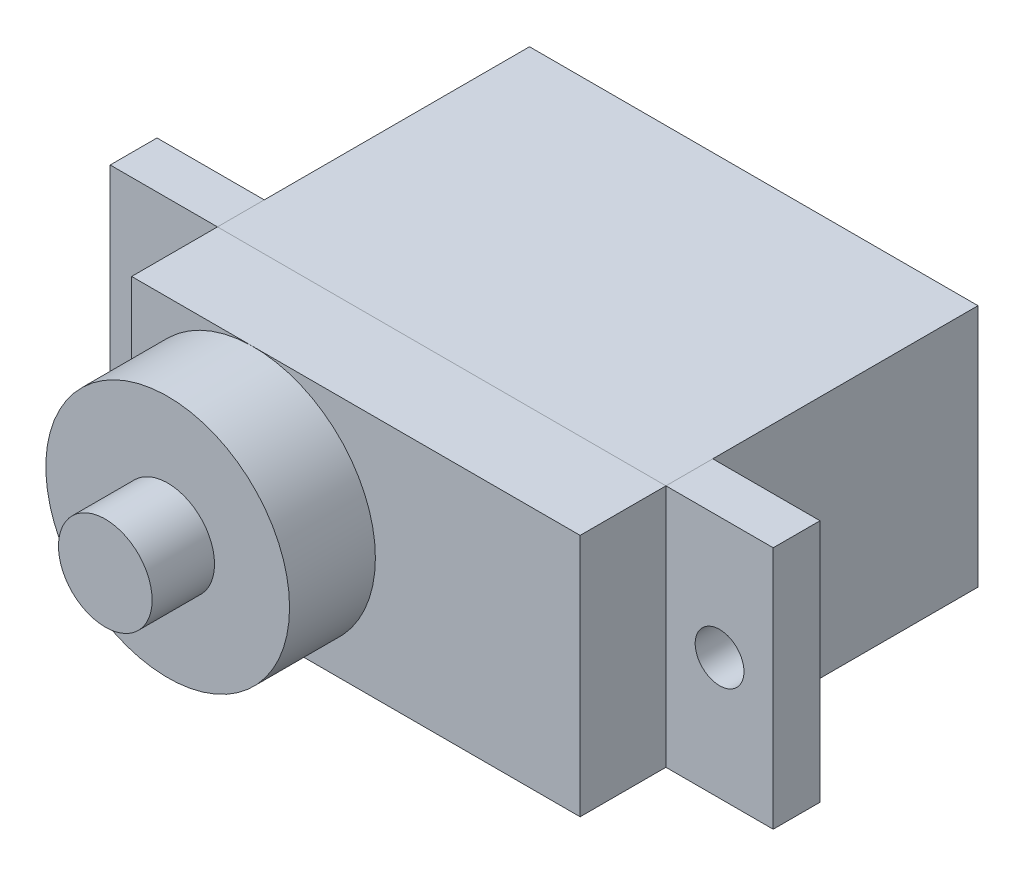
ISO-10303-21;
HEADER;
FILE_DESCRIPTION(('STEP AP214'),'2;1');
FILE_NAME('part.step','',(''),(''),'','','');
FILE_SCHEMA(('AUTOMOTIVE_DESIGN { 1 0 10303 214 1 1 1 1 }'));
ENDSEC;
DATA;
#1=APPLICATION_CONTEXT('core data for automotive mechanical design processes');
#2=APPLICATION_PROTOCOL_DEFINITION('international standard','automotive_design',2000,#1);
#3=PRODUCT_CONTEXT('',#1,'mechanical');
#4=PRODUCT('Part','Part','',(#3));
#5=PRODUCT_RELATED_PRODUCT_CATEGORY('part','',(#4));
#6=PRODUCT_DEFINITION_FORMATION('','',#4);
#7=PRODUCT_DEFINITION_CONTEXT('part definition',#1,'design');
#8=PRODUCT_DEFINITION('design','',#6,#7);
#9=PRODUCT_DEFINITION_SHAPE('','',#8);
#10=(LENGTH_UNIT() NAMED_UNIT(*) SI_UNIT(.MILLI.,.METRE.));
#11=(NAMED_UNIT(*) PLANE_ANGLE_UNIT() SI_UNIT($,.RADIAN.));
#12=(NAMED_UNIT(*) SI_UNIT($,.STERADIAN.) SOLID_ANGLE_UNIT());
#13=UNCERTAINTY_MEASURE_WITH_UNIT(LENGTH_MEASURE(1.E-05),#10,'distance_accuracy_value','');
#14=(GEOMETRIC_REPRESENTATION_CONTEXT(3) GLOBAL_UNCERTAINTY_ASSIGNED_CONTEXT((#13)) GLOBAL_UNIT_ASSIGNED_CONTEXT((#10,
#11,#12)) REPRESENTATION_CONTEXT('',''));
#15=CARTESIAN_POINT('',(0.,0.,0.));
#16=DIRECTION('',(0.,0.,1.));
#17=DIRECTION('',(1.,0.,0.));
#18=AXIS2_PLACEMENT_3D('',#15,#16,#17);
#19=CARTESIAN_POINT('',(222.577910820863,143.525833459981,0.));
#20=DIRECTION('',(0.,0.,1.));
#21=DIRECTION('',(1.,0.,0.));
#22=AXIS2_PLACEMENT_3D('',#19,#20,#21);
#23=CYLINDRICAL_SURFACE('',#22,1.25);
#24=CARTESIAN_POINT('',(222.577910820863,143.525833459981,-2.4));
#25=DIRECTION('',(0.,0.,1.));
#26=DIRECTION('',(1.,0.,0.));
#27=AXIS2_PLACEMENT_3D('',#24,#25,#26);
#28=CIRCLE('',#27,1.25);
#29=CARTESIAN_POINT('',(221.327910820863,143.525833459981,-2.4));
#30=VERTEX_POINT('',#29);
#31=EDGE_CURVE('P0_E35',#30,#30,#28,.T.);
#32=ORIENTED_EDGE('',*,*,#31,.F.);
#33=EDGE_LOOP('',(#32));
#34=FACE_BOUND('',#33,.T.);
#35=CARTESIAN_POINT('',(222.577910820863,143.525833459981,0.));
#36=DIRECTION('',(0.,0.,-1.));
#37=DIRECTION('',(1.,0.,0.));
#38=AXIS2_PLACEMENT_3D('',#35,#36,#37);
#39=CIRCLE('',#38,1.25);
#40=CARTESIAN_POINT('',(221.327910820863,143.525833459981,0.));
#41=VERTEX_POINT('',#40);
#42=EDGE_CURVE('P0_E109',#41,#41,#39,.T.);
#43=ORIENTED_EDGE('',*,*,#42,.F.);
#44=EDGE_LOOP('',(#43));
#45=FACE_BOUND('',#44,.T.);
#46=ADVANCED_FACE('P0_F17',(#34,#45),#23,.F.);
#47=CARTESIAN_POINT('',(225.327910820863,149.775833459981,0.));
#48=DIRECTION('',(1.,0.,0.));
#49=DIRECTION('',(0.,-1.,0.));
#50=AXIS2_PLACEMENT_3D('',#47,#48,#49);
#51=PLANE('',#50);
#52=DIRECTION('',(0.,1.,0.));
#53=VECTOR('',#52,1.);
#54=CARTESIAN_POINT('',(225.327910820863,137.275833459981,0.));
#55=LINE('',#54,#53);
#56=CARTESIAN_POINT('',(225.327910820863,137.275833459981,0.));
#57=VERTEX_POINT('',#56);
#58=CARTESIAN_POINT('',(225.327910820863,149.775833459981,0.));
#59=VERTEX_POINT('',#58);
#60=EDGE_CURVE('P0_E60',#57,#59,#55,.T.);
#61=ORIENTED_EDGE('',*,*,#60,.F.);
#62=DIRECTION('',(0.,0.,-1.));
#63=VECTOR('',#62,1.);
#64=CARTESIAN_POINT('',(225.327910820863,137.275833459981,0.));
#65=LINE('',#64,#63);
#66=CARTESIAN_POINT('',(225.327910820863,137.275833459981,-2.4));
#67=VERTEX_POINT('',#66);
#68=EDGE_CURVE('P0_E11',#57,#67,#65,.T.);
#69=ORIENTED_EDGE('',*,*,#68,.T.);
#70=DIRECTION('',(0.,-1.,0.));
#71=VECTOR('',#70,1.);
#72=CARTESIAN_POINT('',(225.327910820863,137.275833459981,-2.4));
#73=LINE('',#72,#71);
#74=CARTESIAN_POINT('',(225.327910820863,149.775833459981,-2.4));
#75=VERTEX_POINT('',#74);
#76=EDGE_CURVE('P0_E75',#75,#67,#73,.T.);
#77=ORIENTED_EDGE('',*,*,#76,.F.);
#78=DIRECTION('',(0.,0.,-1.));
#79=VECTOR('',#78,1.);
#80=CARTESIAN_POINT('',(225.327910820863,149.775833459981,0.));
#81=LINE('',#80,#79);
#82=EDGE_CURVE('P0_E28',#59,#75,#81,.T.);
#83=ORIENTED_EDGE('',*,*,#82,.F.);
#84=EDGE_LOOP('',(#61,#69,#77,#83));
#85=FACE_BOUND('',#84,.T.);
#86=ADVANCED_FACE('P0_F73',(#85),#51,.T.);
#87=CARTESIAN_POINT('',(219.827910820863,149.775833459981,0.));
#88=DIRECTION('',(0.,1.,0.));
#89=DIRECTION('',(1.,0.,0.));
#90=AXIS2_PLACEMENT_3D('',#87,#88,#89);
#91=PLANE('',#90);
#92=DIRECTION('',(-1.,0.,0.));
#93=VECTOR('',#92,1.);
#94=CARTESIAN_POINT('',(225.327910820863,149.775833459981,0.));
#95=LINE('',#94,#93);
#96=CARTESIAN_POINT('',(219.827910820863,149.775833459981,0.));
#97=VERTEX_POINT('',#96);
#98=EDGE_CURVE('P0_E64',#59,#97,#95,.T.);
#99=ORIENTED_EDGE('',*,*,#98,.F.);
#100=ORIENTED_EDGE('',*,*,#82,.T.);
#101=DIRECTION('',(1.,0.,0.));
#102=VECTOR('',#101,1.);
#103=CARTESIAN_POINT('',(225.327910820863,149.775833459981,-2.4));
#104=LINE('',#103,#102);
#105=CARTESIAN_POINT('',(219.827910820863,149.775833459981,-2.4));
#106=VERTEX_POINT('',#105);
#107=EDGE_CURVE('P0_E91',#106,#75,#104,.T.);
#108=ORIENTED_EDGE('',*,*,#107,.F.);
#109=DIRECTION('',(0.,0.,-1.));
#110=VECTOR('',#109,1.);
#111=CARTESIAN_POINT('',(219.827910820863,149.775833459981,0.));
#112=LINE('',#111,#110);
#113=EDGE_CURVE('P0_E79',#97,#106,#112,.T.);
#114=ORIENTED_EDGE('',*,*,#113,.F.);
#115=EDGE_LOOP('',(#99,#100,#108,#114));
#116=FACE_BOUND('',#115,.T.);
#117=ADVANCED_FACE('P0_F19',(#116),#91,.T.);
#118=CARTESIAN_POINT('',(219.827910820863,137.275833459981,0.));
#119=DIRECTION('',(-1.,0.,0.));
#120=DIRECTION('',(0.,1.,0.));
#121=AXIS2_PLACEMENT_3D('',#118,#119,#120);
#122=PLANE('',#121);
#123=DIRECTION('',(0.,-1.,0.));
#124=VECTOR('',#123,1.);
#125=CARTESIAN_POINT('',(219.827910820863,149.775833459981,0.));
#126=LINE('',#125,#124);
#127=CARTESIAN_POINT('',(219.827910820863,137.275833459981,0.));
#128=VERTEX_POINT('',#127);
#129=EDGE_CURVE('P0_E21',#97,#128,#126,.T.);
#130=ORIENTED_EDGE('',*,*,#129,.F.);
#131=ORIENTED_EDGE('',*,*,#113,.T.);
#132=DIRECTION('',(0.,1.,0.));
#133=VECTOR('',#132,1.);
#134=CARTESIAN_POINT('',(219.827910820863,149.775833459981,-2.4));
#135=LINE('',#134,#133);
#136=CARTESIAN_POINT('',(219.827910820863,137.275833459981,-2.4));
#137=VERTEX_POINT('',#136);
#138=EDGE_CURVE('P0_E89',#137,#106,#135,.T.);
#139=ORIENTED_EDGE('',*,*,#138,.F.);
#140=DIRECTION('',(0.,0.,-1.));
#141=VECTOR('',#140,1.);
#142=CARTESIAN_POINT('',(219.827910820863,137.275833459981,0.));
#143=LINE('',#142,#141);
#144=EDGE_CURVE('P0_E106',#128,#137,#143,.T.);
#145=ORIENTED_EDGE('',*,*,#144,.F.);
#146=EDGE_LOOP('',(#130,#131,#139,#145));
#147=FACE_BOUND('',#146,.T.);
#148=ADVANCED_FACE('P0_F147',(#147),#122,.T.);
#149=CARTESIAN_POINT('',(225.327910820863,137.275833459981,0.));
#150=DIRECTION('',(0.,-1.,0.));
#151=DIRECTION('',(-1.,0.,0.));
#152=AXIS2_PLACEMENT_3D('',#149,#150,#151);
#153=PLANE('',#152);
#154=DIRECTION('',(1.,0.,0.));
#155=VECTOR('',#154,1.);
#156=CARTESIAN_POINT('',(219.827910820863,137.275833459981,0.));
#157=LINE('',#156,#155);
#158=EDGE_CURVE('P0_E67',#128,#57,#157,.T.);
#159=ORIENTED_EDGE('',*,*,#158,.F.);
#160=ORIENTED_EDGE('',*,*,#144,.T.);
#161=DIRECTION('',(-1.,0.,0.));
#162=VECTOR('',#161,1.);
#163=CARTESIAN_POINT('',(219.827910820863,137.275833459981,-2.4));
#164=LINE('',#163,#162);
#165=EDGE_CURVE('P0_E98',#67,#137,#164,.T.);
#166=ORIENTED_EDGE('',*,*,#165,.F.);
#167=ORIENTED_EDGE('',*,*,#68,.F.);
#168=EDGE_LOOP('',(#159,#160,#166,#167));
#169=FACE_BOUND('',#168,.T.);
#170=ADVANCED_FACE('P0_F138',(#169),#153,.T.);
#171=CARTESIAN_POINT('',(222.577910820863,143.525833459981,0.));
#172=DIRECTION('',(0.,0.,1.));
#173=DIRECTION('',(1.,0.,0.));
#174=AXIS2_PLACEMENT_3D('',#171,#172,#173);
#175=PLANE('',#174);
#176=ORIENTED_EDGE('',*,*,#42,.T.);
#177=EDGE_LOOP('',(#176));
#178=FACE_BOUND('',#177,.T.);
#179=ORIENTED_EDGE('',*,*,#158,.T.);
#180=ORIENTED_EDGE('',*,*,#60,.T.);
#181=ORIENTED_EDGE('',*,*,#98,.T.);
#182=ORIENTED_EDGE('',*,*,#129,.T.);
#183=EDGE_LOOP('',(#179,#180,#181,#182));
#184=FACE_BOUND('',#183,.T.);
#185=ADVANCED_FACE('P0_F62',(#178,#184),#175,.T.);
#186=CARTESIAN_POINT('',(222.577910820863,143.525833459981,-2.4));
#187=DIRECTION('',(0.,0.,1.));
#188=DIRECTION('',(1.,0.,0.));
#189=AXIS2_PLACEMENT_3D('',#186,#187,#188);
#190=PLANE('',#189);
#191=ORIENTED_EDGE('',*,*,#31,.T.);
#192=EDGE_LOOP('',(#191));
#193=FACE_BOUND('',#192,.T.);
#194=ORIENTED_EDGE('',*,*,#165,.T.);
#195=ORIENTED_EDGE('',*,*,#138,.T.);
#196=ORIENTED_EDGE('',*,*,#107,.T.);
#197=ORIENTED_EDGE('',*,*,#76,.T.);
#198=EDGE_LOOP('',(#194,#195,#196,#197));
#199=FACE_BOUND('',#198,.T.);
#200=ADVANCED_FACE('P0_F125',(#193,#199),#190,.F.);
#201=CLOSED_SHELL('',(#46,#86,#117,#148,#170,#185,#200));
#202=MANIFOLD_SOLID_BREP('P0_B1',#201);
#203=CARTESIAN_POINT('',(251.073310820863,143.525833459981,0.));
#204=DIRECTION('',(0.,0.,1.));
#205=DIRECTION('',(-1.,0.,0.));
#206=AXIS2_PLACEMENT_3D('',#203,#204,#205);
#207=CYLINDRICAL_SURFACE('',#206,1.25);
#208=CARTESIAN_POINT('',(251.073310820863,143.525833459981,-2.4));
#209=DIRECTION('',(0.,0.,1.));
#210=DIRECTION('',(-1.,0.,0.));
#211=AXIS2_PLACEMENT_3D('',#208,#209,#210);
#212=CIRCLE('',#211,1.25);
#213=CARTESIAN_POINT('',(252.323310820863,143.525833459981,-2.4));
#214=VERTEX_POINT('',#213);
#215=EDGE_CURVE('P1_E35',#214,#214,#212,.T.);
#216=ORIENTED_EDGE('',*,*,#215,.F.);
#217=EDGE_LOOP('',(#216));
#218=FACE_BOUND('',#217,.T.);
#219=CARTESIAN_POINT('',(251.073310820863,143.525833459981,0.));
#220=DIRECTION('',(0.,0.,-1.));
#221=DIRECTION('',(-1.,0.,0.));
#222=AXIS2_PLACEMENT_3D('',#219,#220,#221);
#223=CIRCLE('',#222,1.25);
#224=CARTESIAN_POINT('',(252.323310820863,143.525833459981,0.));
#225=VERTEX_POINT('',#224);
#226=EDGE_CURVE('P1_E21',#225,#225,#223,.T.);
#227=ORIENTED_EDGE('',*,*,#226,.F.);
#228=EDGE_LOOP('',(#227));
#229=FACE_BOUND('',#228,.T.);
#230=ADVANCED_FACE('P1_F17',(#218,#229),#207,.F.);
#231=CARTESIAN_POINT('',(248.323310820863,149.775833459981,0.));
#232=DIRECTION('',(0.,1.,0.));
#233=DIRECTION('',(1.,0.,0.));
#234=AXIS2_PLACEMENT_3D('',#231,#232,#233);
#235=PLANE('',#234);
#236=DIRECTION('',(-1.,0.,0.));
#237=VECTOR('',#236,1.);
#238=CARTESIAN_POINT('',(253.823310820864,149.775833459981,0.));
#239=LINE('',#238,#237);
#240=CARTESIAN_POINT('',(253.823310820864,149.775833459981,0.));
#241=VERTEX_POINT('',#240);
#242=CARTESIAN_POINT('',(248.323310820863,149.775833459981,0.));
#243=VERTEX_POINT('',#242);
#244=EDGE_CURVE('P1_E74',#241,#243,#239,.T.);
#245=ORIENTED_EDGE('',*,*,#244,.F.);
#246=DIRECTION('',(0.,0.,-1.));
#247=VECTOR('',#246,1.);
#248=CARTESIAN_POINT('',(253.823310820864,149.775833459981,0.));
#249=LINE('',#248,#247);
#250=CARTESIAN_POINT('',(253.823310820864,149.775833459981,-2.4));
#251=VERTEX_POINT('',#250);
#252=EDGE_CURVE('P1_E11',#241,#251,#249,.T.);
#253=ORIENTED_EDGE('',*,*,#252,.T.);
#254=DIRECTION('',(1.,0.,0.));
#255=VECTOR('',#254,1.);
#256=CARTESIAN_POINT('',(253.823310820864,149.775833459981,-2.4));
#257=LINE('',#256,#255);
#258=CARTESIAN_POINT('',(248.323310820863,149.775833459981,-2.4));
#259=VERTEX_POINT('',#258);
#260=EDGE_CURVE('P1_E71',#259,#251,#257,.T.);
#261=ORIENTED_EDGE('',*,*,#260,.F.);
#262=DIRECTION('',(0.,0.,-1.));
#263=VECTOR('',#262,1.);
#264=CARTESIAN_POINT('',(248.323310820863,149.775833459981,0.));
#265=LINE('',#264,#263);
#266=EDGE_CURVE('P1_E28',#243,#259,#265,.T.);
#267=ORIENTED_EDGE('',*,*,#266,.F.);
#268=EDGE_LOOP('',(#245,#253,#261,#267));
#269=FACE_BOUND('',#268,.T.);
#270=ADVANCED_FACE('P1_F81',(#269),#235,.T.);
#271=CARTESIAN_POINT('',(248.323310820863,137.275833459981,0.));
#272=DIRECTION('',(-1.,0.,0.));
#273=DIRECTION('',(0.,1.,0.));
#274=AXIS2_PLACEMENT_3D('',#271,#272,#273);
#275=PLANE('',#274);
#276=DIRECTION('',(0.,-1.,0.));
#277=VECTOR('',#276,1.);
#278=CARTESIAN_POINT('',(248.323310820863,149.775833459981,0.));
#279=LINE('',#278,#277);
#280=CARTESIAN_POINT('',(248.323310820863,137.275833459981,0.));
#281=VERTEX_POINT('',#280);
#282=EDGE_CURVE('P1_E54',#243,#281,#279,.T.);
#283=ORIENTED_EDGE('',*,*,#282,.F.);
#284=ORIENTED_EDGE('',*,*,#266,.T.);
#285=DIRECTION('',(0.,1.,0.));
#286=VECTOR('',#285,1.);
#287=CARTESIAN_POINT('',(248.323310820863,149.775833459981,-2.4));
#288=LINE('',#287,#286);
#289=CARTESIAN_POINT('',(248.323310820863,137.275833459981,-2.4));
#290=VERTEX_POINT('',#289);
#291=EDGE_CURVE('P1_E103',#290,#259,#288,.T.);
#292=ORIENTED_EDGE('',*,*,#291,.F.);
#293=DIRECTION('',(0.,0.,-1.));
#294=VECTOR('',#293,1.);
#295=CARTESIAN_POINT('',(248.323310820863,137.275833459981,0.));
#296=LINE('',#295,#294);
#297=EDGE_CURVE('P1_E85',#281,#290,#296,.T.);
#298=ORIENTED_EDGE('',*,*,#297,.F.);
#299=EDGE_LOOP('',(#283,#284,#292,#298));
#300=FACE_BOUND('',#299,.T.);
#301=ADVANCED_FACE('P1_F87',(#300),#275,.T.);
#302=CARTESIAN_POINT('',(253.823310820864,137.275833459981,0.));
#303=DIRECTION('',(0.,-1.,0.));
#304=DIRECTION('',(-1.,0.,0.));
#305=AXIS2_PLACEMENT_3D('',#302,#303,#304);
#306=PLANE('',#305);
#307=DIRECTION('',(1.,0.,0.));
#308=VECTOR('',#307,1.);
#309=CARTESIAN_POINT('',(248.323310820863,137.275833459981,0.));
#310=LINE('',#309,#308);
#311=CARTESIAN_POINT('',(253.823310820864,137.275833459981,0.));
#312=VERTEX_POINT('',#311);
#313=EDGE_CURVE('P1_E90',#281,#312,#310,.T.);
#314=ORIENTED_EDGE('',*,*,#313,.F.);
#315=ORIENTED_EDGE('',*,*,#297,.T.);
#316=DIRECTION('',(-1.,0.,0.));
#317=VECTOR('',#316,1.);
#318=CARTESIAN_POINT('',(248.323310820863,137.275833459981,-2.4));
#319=LINE('',#318,#317);
#320=CARTESIAN_POINT('',(253.823310820864,137.275833459981,-2.4));
#321=VERTEX_POINT('',#320);
#322=EDGE_CURVE('P1_E63',#321,#290,#319,.T.);
#323=ORIENTED_EDGE('',*,*,#322,.F.);
#324=DIRECTION('',(0.,0.,-1.));
#325=VECTOR('',#324,1.);
#326=CARTESIAN_POINT('',(253.823310820864,137.275833459981,0.));
#327=LINE('',#326,#325);
#328=EDGE_CURVE('P1_E100',#312,#321,#327,.T.);
#329=ORIENTED_EDGE('',*,*,#328,.F.);
#330=EDGE_LOOP('',(#314,#315,#323,#329));
#331=FACE_BOUND('',#330,.T.);
#332=ADVANCED_FACE('P1_F132',(#331),#306,.T.);
#333=CARTESIAN_POINT('',(253.823310820864,149.775833459981,0.));
#334=DIRECTION('',(1.,0.,0.));
#335=DIRECTION('',(0.,-1.,0.));
#336=AXIS2_PLACEMENT_3D('',#333,#334,#335);
#337=PLANE('',#336);
#338=DIRECTION('',(0.,1.,0.));
#339=VECTOR('',#338,1.);
#340=CARTESIAN_POINT('',(253.823310820864,137.275833459981,0.));
#341=LINE('',#340,#339);
#342=EDGE_CURVE('P1_E77',#312,#241,#341,.T.);
#343=ORIENTED_EDGE('',*,*,#342,.F.);
#344=ORIENTED_EDGE('',*,*,#328,.T.);
#345=DIRECTION('',(0.,-1.,0.));
#346=VECTOR('',#345,1.);
#347=CARTESIAN_POINT('',(253.823310820864,137.275833459981,-2.4));
#348=LINE('',#347,#346);
#349=EDGE_CURVE('P1_E102',#251,#321,#348,.T.);
#350=ORIENTED_EDGE('',*,*,#349,.F.);
#351=ORIENTED_EDGE('',*,*,#252,.F.);
#352=EDGE_LOOP('',(#343,#344,#350,#351));
#353=FACE_BOUND('',#352,.T.);
#354=ADVANCED_FACE('P1_F135',(#353),#337,.T.);
#355=CARTESIAN_POINT('',(251.073310820863,143.525833459981,0.));
#356=DIRECTION('',(0.,0.,1.));
#357=DIRECTION('',(1.,0.,0.));
#358=AXIS2_PLACEMENT_3D('',#355,#356,#357);
#359=PLANE('',#358);
#360=ORIENTED_EDGE('',*,*,#226,.T.);
#361=EDGE_LOOP('',(#360));
#362=FACE_BOUND('',#361,.T.);
#363=ORIENTED_EDGE('',*,*,#342,.T.);
#364=ORIENTED_EDGE('',*,*,#244,.T.);
#365=ORIENTED_EDGE('',*,*,#282,.T.);
#366=ORIENTED_EDGE('',*,*,#313,.T.);
#367=EDGE_LOOP('',(#363,#364,#365,#366));
#368=FACE_BOUND('',#367,.T.);
#369=ADVANCED_FACE('P1_F75',(#362,#368),#359,.T.);
#370=CARTESIAN_POINT('',(251.073310820863,143.525833459981,-2.4));
#371=DIRECTION('',(0.,0.,1.));
#372=DIRECTION('',(1.,0.,0.));
#373=AXIS2_PLACEMENT_3D('',#370,#371,#372);
#374=PLANE('',#373);
#375=ORIENTED_EDGE('',*,*,#215,.T.);
#376=EDGE_LOOP('',(#375));
#377=FACE_BOUND('',#376,.T.);
#378=ORIENTED_EDGE('',*,*,#349,.T.);
#379=ORIENTED_EDGE('',*,*,#322,.T.);
#380=ORIENTED_EDGE('',*,*,#291,.T.);
#381=ORIENTED_EDGE('',*,*,#260,.T.);
#382=EDGE_LOOP('',(#378,#379,#380,#381));
#383=FACE_BOUND('',#382,.T.);
#384=ADVANCED_FACE('P1_F19',(#377,#383),#374,.F.);
#385=CLOSED_SHELL('',(#230,#270,#301,#332,#354,#369,#384));
#386=MANIFOLD_SOLID_BREP('P1_B1',#385);
#387=CARTESIAN_POINT('',(225.327910820863,137.278333459981,0.));
#388=DIRECTION('',(-1.,0.,0.));
#389=DIRECTION('',(0.,1.,0.));
#390=AXIS2_PLACEMENT_3D('',#387,#388,#389);
#391=PLANE('',#390);
#392=DIRECTION('',(0.,1.,0.));
#393=VECTOR('',#392,1.);
#394=CARTESIAN_POINT('',(225.327910820863,137.278333459981,0.));
#395=LINE('',#394,#393);
#396=CARTESIAN_POINT('',(225.327910820863,137.278333459981,0.));
#397=VERTEX_POINT('',#396);
#398=CARTESIAN_POINT('',(225.327910820863,149.775833459981,0.));
#399=VERTEX_POINT('',#398);
#400=EDGE_CURVE('P2_E11',#397,#399,#395,.T.);
#401=ORIENTED_EDGE('',*,*,#400,.T.);
#402=DIRECTION('',(0.,0.,-1.));
#403=VECTOR('',#402,1.);
#404=CARTESIAN_POINT('',(225.327910820863,149.775833459981,0.));
#405=LINE('',#404,#403);
#406=CARTESIAN_POINT('',(225.327910820863,149.775833459981,-16.));
#407=VERTEX_POINT('',#406);
#408=EDGE_CURVE('P2_E27',#399,#407,#405,.T.);
#409=ORIENTED_EDGE('',*,*,#408,.T.);
#410=DIRECTION('',(0.,1.,0.));
#411=VECTOR('',#410,1.);
#412=CARTESIAN_POINT('',(225.327910820863,137.278333459981,-16.));
#413=LINE('',#412,#411);
#414=CARTESIAN_POINT('',(225.327910820863,137.278333459981,-16.));
#415=VERTEX_POINT('',#414);
#416=EDGE_CURVE('P2_E53',#415,#407,#413,.T.);
#417=ORIENTED_EDGE('',*,*,#416,.F.);
#418=DIRECTION('',(0.,0.,-1.));
#419=VECTOR('',#418,1.);
#420=CARTESIAN_POINT('',(225.327910820863,137.278333459981,0.));
#421=LINE('',#420,#419);
#422=EDGE_CURVE('P2_E55',#397,#415,#421,.T.);
#423=ORIENTED_EDGE('',*,*,#422,.F.);
#424=EDGE_LOOP('',(#401,#409,#417,#423));
#425=FACE_BOUND('',#424,.T.);
#426=ADVANCED_FACE('P2_F17',(#425),#391,.T.);
#427=CARTESIAN_POINT('',(248.323310820863,137.278333459981,0.));
#428=DIRECTION('',(0.,-1.,0.));
#429=DIRECTION('',(-1.,0.,0.));
#430=AXIS2_PLACEMENT_3D('',#427,#428,#429);
#431=PLANE('',#430);
#432=DIRECTION('',(-1.,0.,0.));
#433=VECTOR('',#432,1.);
#434=CARTESIAN_POINT('',(248.323310820863,137.278333459981,0.));
#435=LINE('',#434,#433);
#436=CARTESIAN_POINT('',(248.323310820863,137.278333459981,0.));
#437=VERTEX_POINT('',#436);
#438=EDGE_CURVE('P2_E68',#437,#397,#435,.T.);
#439=ORIENTED_EDGE('',*,*,#438,.T.);
#440=ORIENTED_EDGE('',*,*,#422,.T.);
#441=DIRECTION('',(-1.,0.,0.));
#442=VECTOR('',#441,1.);
#443=CARTESIAN_POINT('',(248.323310820863,137.278333459981,-16.));
#444=LINE('',#443,#442);
#445=CARTESIAN_POINT('',(248.323310820863,137.278333459981,-16.));
#446=VERTEX_POINT('',#445);
#447=EDGE_CURVE('P2_E61',#446,#415,#444,.T.);
#448=ORIENTED_EDGE('',*,*,#447,.F.);
#449=DIRECTION('',(0.,0.,-1.));
#450=VECTOR('',#449,1.);
#451=CARTESIAN_POINT('',(248.323310820863,137.278333459981,0.));
#452=LINE('',#451,#450);
#453=EDGE_CURVE('P2_E91',#437,#446,#452,.T.);
#454=ORIENTED_EDGE('',*,*,#453,.F.);
#455=EDGE_LOOP('',(#439,#440,#448,#454));
#456=FACE_BOUND('',#455,.T.);
#457=ADVANCED_FACE('P2_F65',(#456),#431,.T.);
#458=CARTESIAN_POINT('',(248.323310820863,149.775833459981,0.));
#459=DIRECTION('',(1.,0.,0.));
#460=DIRECTION('',(0.,-1.,0.));
#461=AXIS2_PLACEMENT_3D('',#458,#459,#460);
#462=PLANE('',#461);
#463=DIRECTION('',(0.,-1.,0.));
#464=VECTOR('',#463,1.);
#465=CARTESIAN_POINT('',(248.323310820863,149.775833459981,0.));
#466=LINE('',#465,#464);
#467=CARTESIAN_POINT('',(248.323310820863,149.775833459981,0.));
#468=VERTEX_POINT('',#467);
#469=EDGE_CURVE('P2_E70',#468,#437,#466,.T.);
#470=ORIENTED_EDGE('',*,*,#469,.T.);
#471=ORIENTED_EDGE('',*,*,#453,.T.);
#472=DIRECTION('',(0.,-1.,0.));
#473=VECTOR('',#472,1.);
#474=CARTESIAN_POINT('',(248.323310820863,149.775833459981,-16.));
#475=LINE('',#474,#473);
#476=CARTESIAN_POINT('',(248.323310820863,149.775833459981,-16.));
#477=VERTEX_POINT('',#476);
#478=EDGE_CURVE('P2_E74',#477,#446,#475,.T.);
#479=ORIENTED_EDGE('',*,*,#478,.F.);
#480=DIRECTION('',(0.,0.,-1.));
#481=VECTOR('',#480,1.);
#482=CARTESIAN_POINT('',(248.323310820863,149.775833459981,0.));
#483=LINE('',#482,#481);
#484=EDGE_CURVE('P2_E96',#468,#477,#483,.T.);
#485=ORIENTED_EDGE('',*,*,#484,.F.);
#486=EDGE_LOOP('',(#470,#471,#479,#485));
#487=FACE_BOUND('',#486,.T.);
#488=ADVANCED_FACE('P2_F108',(#487),#462,.T.);
#489=CARTESIAN_POINT('',(225.327910820863,149.775833459981,0.));
#490=DIRECTION('',(0.,1.,0.));
#491=DIRECTION('',(1.,0.,0.));
#492=AXIS2_PLACEMENT_3D('',#489,#490,#491);
#493=PLANE('',#492);
#494=DIRECTION('',(1.,0.,0.));
#495=VECTOR('',#494,1.);
#496=CARTESIAN_POINT('',(225.327910820863,149.775833459981,0.));
#497=LINE('',#496,#495);
#498=EDGE_CURVE('P2_E94',#399,#468,#497,.T.);
#499=ORIENTED_EDGE('',*,*,#498,.T.);
#500=ORIENTED_EDGE('',*,*,#484,.T.);
#501=DIRECTION('',(1.,0.,0.));
#502=VECTOR('',#501,1.);
#503=CARTESIAN_POINT('',(225.327910820863,149.775833459981,-16.));
#504=LINE('',#503,#502);
#505=EDGE_CURVE('P2_E80',#407,#477,#504,.T.);
#506=ORIENTED_EDGE('',*,*,#505,.F.);
#507=ORIENTED_EDGE('',*,*,#408,.F.);
#508=EDGE_LOOP('',(#499,#500,#506,#507));
#509=FACE_BOUND('',#508,.T.);
#510=ADVANCED_FACE('P2_F104',(#509),#493,.T.);
#511=CARTESIAN_POINT('',(236.825610820863,143.527083459981,-16.));
#512=DIRECTION('',(0.,0.,-1.));
#513=DIRECTION('',(-1.,0.,0.));
#514=AXIS2_PLACEMENT_3D('',#511,#512,#513);
#515=PLANE('',#514);
#516=ORIENTED_EDGE('',*,*,#505,.T.);
#517=ORIENTED_EDGE('',*,*,#478,.T.);
#518=ORIENTED_EDGE('',*,*,#447,.T.);
#519=ORIENTED_EDGE('',*,*,#416,.T.);
#520=EDGE_LOOP('',(#516,#517,#518,#519));
#521=FACE_BOUND('',#520,.T.);
#522=ADVANCED_FACE('P2_F73',(#521),#515,.T.);
#523=CARTESIAN_POINT('',(236.825610820863,143.527083459981,0.));
#524=DIRECTION('',(0.,0.,1.));
#525=DIRECTION('',(1.,0.,0.));
#526=AXIS2_PLACEMENT_3D('',#523,#524,#525);
#527=PLANE('',#526);
#528=ORIENTED_EDGE('',*,*,#498,.F.);
#529=ORIENTED_EDGE('',*,*,#400,.F.);
#530=ORIENTED_EDGE('',*,*,#438,.F.);
#531=ORIENTED_EDGE('',*,*,#469,.F.);
#532=EDGE_LOOP('',(#528,#529,#530,#531));
#533=FACE_BOUND('',#532,.T.);
#534=ADVANCED_FACE('P2_F19',(#533),#527,.T.);
#535=CLOSED_SHELL('',(#426,#457,#488,#510,#522,#534));
#536=MANIFOLD_SOLID_BREP('P2_B1',#535);
#537=CARTESIAN_POINT('',(248.323310820863,137.278333459981,0.));
#538=DIRECTION('',(1.,0.,0.));
#539=DIRECTION('',(0.,1.,0.));
#540=AXIS2_PLACEMENT_3D('',#537,#538,#539);
#541=PLANE('',#540);
#542=DIRECTION('',(0.,-1.,0.));
#543=VECTOR('',#542,1.);
#544=CARTESIAN_POINT('',(248.323310820863,149.775833459981,0.));
#545=LINE('',#544,#543);
#546=CARTESIAN_POINT('',(248.323310820863,149.775833459981,0.));
#547=VERTEX_POINT('',#546);
#548=CARTESIAN_POINT('',(248.323310820863,137.278333459981,0.));
#549=VERTEX_POINT('',#548);
#550=EDGE_CURVE('P3_E34',#547,#549,#545,.T.);
#551=ORIENTED_EDGE('',*,*,#550,.F.);
#552=DIRECTION('',(0.,0.,1.));
#553=VECTOR('',#552,1.);
#554=CARTESIAN_POINT('',(248.323310820863,149.775833459981,0.));
#555=LINE('',#554,#553);
#556=CARTESIAN_POINT('',(248.323310820863,149.775833459981,4.4));
#557=VERTEX_POINT('',#556);
#558=EDGE_CURVE('P3_E11',#547,#557,#555,.T.);
#559=ORIENTED_EDGE('',*,*,#558,.T.);
#560=DIRECTION('',(0.,1.,0.));
#561=VECTOR('',#560,1.);
#562=CARTESIAN_POINT('',(248.323310820863,149.775833459981,4.4));
#563=LINE('',#562,#561);
#564=CARTESIAN_POINT('',(248.323310820863,137.278333459981,4.4));
#565=VERTEX_POINT('',#564);
#566=EDGE_CURVE('P3_E63',#565,#557,#563,.T.);
#567=ORIENTED_EDGE('',*,*,#566,.F.);
#568=DIRECTION('',(0.,0.,1.));
#569=VECTOR('',#568,1.);
#570=CARTESIAN_POINT('',(248.323310820863,137.278333459981,0.));
#571=LINE('',#570,#569);
#572=EDGE_CURVE('P3_E27',#549,#565,#571,.T.);
#573=ORIENTED_EDGE('',*,*,#572,.F.);
#574=EDGE_LOOP('',(#551,#559,#567,#573));
#575=FACE_BOUND('',#574,.T.);
#576=ADVANCED_FACE('P3_F17',(#575),#541,.T.);
#577=CARTESIAN_POINT('',(225.327910820863,137.278333459981,0.));
#578=DIRECTION('',(0.,-1.,0.));
#579=DIRECTION('',(1.,0.,0.));
#580=AXIS2_PLACEMENT_3D('',#577,#578,#579);
#581=PLANE('',#580);
#582=DIRECTION('',(-1.,0.,0.));
#583=VECTOR('',#582,1.);
#584=CARTESIAN_POINT('',(248.323310820863,137.278333459981,0.));
#585=LINE('',#584,#583);
#586=CARTESIAN_POINT('',(225.327910820863,137.278333459981,0.));
#587=VERTEX_POINT('',#586);
#588=EDGE_CURVE('P3_E47',#549,#587,#585,.T.);
#589=ORIENTED_EDGE('',*,*,#588,.F.);
#590=ORIENTED_EDGE('',*,*,#572,.T.);
#591=DIRECTION('',(1.,0.,0.));
#592=VECTOR('',#591,1.);
#593=CARTESIAN_POINT('',(248.323310820863,137.278333459981,4.4));
#594=LINE('',#593,#592);
#595=CARTESIAN_POINT('',(225.327910820863,137.278333459981,4.4));
#596=VERTEX_POINT('',#595);
#597=EDGE_CURVE('P3_E70',#596,#565,#594,.T.);
#598=ORIENTED_EDGE('',*,*,#597,.F.);
#599=DIRECTION('',(0.,0.,1.));
#600=VECTOR('',#599,1.);
#601=CARTESIAN_POINT('',(225.327910820863,137.278333459981,0.));
#602=LINE('',#601,#600);
#603=EDGE_CURVE('P3_E75',#587,#596,#602,.T.);
#604=ORIENTED_EDGE('',*,*,#603,.F.);
#605=EDGE_LOOP('',(#589,#590,#598,#604));
#606=FACE_BOUND('',#605,.T.);
#607=ADVANCED_FACE('P3_F73',(#606),#581,.T.);
#608=CARTESIAN_POINT('',(225.327910820863,149.775833459981,0.));
#609=DIRECTION('',(-1.,0.,0.));
#610=DIRECTION('',(0.,-1.,0.));
#611=AXIS2_PLACEMENT_3D('',#608,#609,#610);
#612=PLANE('',#611);
#613=DIRECTION('',(0.,1.,0.));
#614=VECTOR('',#613,1.);
#615=CARTESIAN_POINT('',(225.327910820863,137.278333459981,0.));
#616=LINE('',#615,#614);
#617=CARTESIAN_POINT('',(225.327910820863,149.775833459981,0.));
#618=VERTEX_POINT('',#617);
#619=EDGE_CURVE('P3_E90',#587,#618,#616,.T.);
#620=ORIENTED_EDGE('',*,*,#619,.F.);
#621=ORIENTED_EDGE('',*,*,#603,.T.);
#622=DIRECTION('',(0.,-1.,0.));
#623=VECTOR('',#622,1.);
#624=CARTESIAN_POINT('',(225.327910820863,137.278333459981,4.4));
#625=LINE('',#624,#623);
#626=CARTESIAN_POINT('',(225.327910820863,149.775833459981,4.4));
#627=VERTEX_POINT('',#626);
#628=EDGE_CURVE('P3_E58',#627,#596,#625,.T.);
#629=ORIENTED_EDGE('',*,*,#628,.F.);
#630=DIRECTION('',(0.,0.,1.));
#631=VECTOR('',#630,1.);
#632=CARTESIAN_POINT('',(225.327910820863,149.775833459981,0.));
#633=LINE('',#632,#631);
#634=EDGE_CURVE('P3_E89',#618,#627,#633,.T.);
#635=ORIENTED_EDGE('',*,*,#634,.F.);
#636=EDGE_LOOP('',(#620,#621,#629,#635));
#637=FACE_BOUND('',#636,.T.);
#638=ADVANCED_FACE('P3_F19',(#637),#612,.T.);
#639=CARTESIAN_POINT('',(248.323310820863,149.775833459981,0.));
#640=DIRECTION('',(0.,1.,0.));
#641=DIRECTION('',(-1.,0.,0.));
#642=AXIS2_PLACEMENT_3D('',#639,#640,#641);
#643=PLANE('',#642);
#644=DIRECTION('',(1.,0.,0.));
#645=VECTOR('',#644,1.);
#646=CARTESIAN_POINT('',(225.327910820863,149.775833459981,0.));
#647=LINE('',#646,#645);
#648=EDGE_CURVE('P3_E94',#618,#547,#647,.T.);
#649=ORIENTED_EDGE('',*,*,#648,.F.);
#650=ORIENTED_EDGE('',*,*,#634,.T.);
#651=DIRECTION('',(-1.,0.,0.));
#652=VECTOR('',#651,1.);
#653=CARTESIAN_POINT('',(225.327910820863,149.775833459981,4.4));
#654=LINE('',#653,#652);
#655=EDGE_CURVE('P3_E83',#557,#627,#654,.T.);
#656=ORIENTED_EDGE('',*,*,#655,.F.);
#657=ORIENTED_EDGE('',*,*,#558,.F.);
#658=EDGE_LOOP('',(#649,#650,#656,#657));
#659=FACE_BOUND('',#658,.T.);
#660=ADVANCED_FACE('P3_F107',(#659),#643,.T.);
#661=CARTESIAN_POINT('',(236.825610820863,143.527083459981,0.));
#662=DIRECTION('',(0.,0.,1.));
#663=DIRECTION('',(1.,0.,0.));
#664=AXIS2_PLACEMENT_3D('',#661,#662,#663);
#665=PLANE('',#664);
#666=ORIENTED_EDGE('',*,*,#648,.T.);
#667=ORIENTED_EDGE('',*,*,#550,.T.);
#668=ORIENTED_EDGE('',*,*,#588,.T.);
#669=ORIENTED_EDGE('',*,*,#619,.T.);
#670=EDGE_LOOP('',(#666,#667,#668,#669));
#671=FACE_BOUND('',#670,.T.);
#672=ADVANCED_FACE('P3_F109',(#671),#665,.F.);
#673=CARTESIAN_POINT('',(236.825610820863,143.527083459981,4.4));
#674=DIRECTION('',(0.,0.,1.));
#675=DIRECTION('',(1.,0.,0.));
#676=AXIS2_PLACEMENT_3D('',#673,#674,#675);
#677=PLANE('',#676);
#678=ORIENTED_EDGE('',*,*,#655,.T.);
#679=ORIENTED_EDGE('',*,*,#628,.T.);
#680=ORIENTED_EDGE('',*,*,#597,.T.);
#681=ORIENTED_EDGE('',*,*,#566,.T.);
#682=EDGE_LOOP('',(#678,#679,#680,#681));
#683=FACE_BOUND('',#682,.T.);
#684=ADVANCED_FACE('P3_F77',(#683),#677,.T.);
#685=CLOSED_SHELL('',(#576,#607,#638,#660,#672,#684));
#686=MANIFOLD_SOLID_BREP('P3_B1',#685);
#687=CARTESIAN_POINT('',(231.576660820863,143.527083459981,0.));
#688=DIRECTION('',(0.,0.,-1.));
#689=DIRECTION('',(-1.,0.,0.));
#690=AXIS2_PLACEMENT_3D('',#687,#688,#689);
#691=CYLINDRICAL_SURFACE('',#690,6.24875);
#692=CARTESIAN_POINT('',(231.576660820863,143.527083459981,8.8));
#693=DIRECTION('',(0.,0.,1.));
#694=DIRECTION('',(-1.,0.,0.));
#695=AXIS2_PLACEMENT_3D('',#692,#693,#694);
#696=CIRCLE('',#695,6.24875);
#697=CARTESIAN_POINT('',(237.825410820863,143.527083459981,8.8));
#698=VERTEX_POINT('',#697);
#699=EDGE_CURVE('P4_E21',#698,#698,#696,.T.);
#700=ORIENTED_EDGE('',*,*,#699,.F.);
#701=EDGE_LOOP('',(#700));
#702=FACE_BOUND('',#701,.T.);
#703=CARTESIAN_POINT('',(231.576660820863,143.527083459981,0.));
#704=DIRECTION('',(0.,0.,1.));
#705=DIRECTION('',(-1.,0.,0.));
#706=AXIS2_PLACEMENT_3D('',#703,#704,#705);
#707=CIRCLE('',#706,6.24875);
#708=CARTESIAN_POINT('',(237.825410820863,143.527083459981,0.));
#709=VERTEX_POINT('',#708);
#710=EDGE_CURVE('P4_E11',#709,#709,#707,.T.);
#711=ORIENTED_EDGE('',*,*,#710,.T.);
#712=EDGE_LOOP('',(#711));
#713=FACE_BOUND('',#712,.T.);
#714=ADVANCED_FACE('P4_F17',(#702,#713),#691,.T.);
#715=CARTESIAN_POINT('',(231.576660820863,143.527083459981,8.8));
#716=DIRECTION('',(0.,0.,1.));
#717=DIRECTION('',(1.,0.,0.));
#718=AXIS2_PLACEMENT_3D('',#715,#716,#717);
#719=PLANE('',#718);
#720=ORIENTED_EDGE('',*,*,#699,.T.);
#721=EDGE_LOOP('',(#720));
#722=FACE_BOUND('',#721,.T.);
#723=ADVANCED_FACE('P4_F35',(#722),#719,.T.);
#724=CARTESIAN_POINT('',(231.576660820863,143.527083459981,0.));
#725=DIRECTION('',(0.,0.,1.));
#726=DIRECTION('',(1.,0.,0.));
#727=AXIS2_PLACEMENT_3D('',#724,#725,#726);
#728=PLANE('',#727);
#729=ORIENTED_EDGE('',*,*,#710,.F.);
#730=EDGE_LOOP('',(#729));
#731=FACE_BOUND('',#730,.T.);
#732=ADVANCED_FACE('P4_F19',(#731),#728,.F.);
#733=CLOSED_SHELL('',(#714,#723,#732));
#734=MANIFOLD_SOLID_BREP('P4_B1',#733);
#735=CARTESIAN_POINT('',(231.576660820863,143.527083459981,0.));
#736=DIRECTION('',(0.,0.,-1.));
#737=DIRECTION('',(-1.,0.,0.));
#738=AXIS2_PLACEMENT_3D('',#735,#736,#737);
#739=CYLINDRICAL_SURFACE('',#738,2.4);
#740=CARTESIAN_POINT('',(231.576660820863,143.527083459981,12.));
#741=DIRECTION('',(0.,0.,1.));
#742=DIRECTION('',(-1.,0.,0.));
#743=AXIS2_PLACEMENT_3D('',#740,#741,#742);
#744=CIRCLE('',#743,2.4);
#745=CARTESIAN_POINT('',(233.976660820863,143.527083459981,12.));
#746=VERTEX_POINT('',#745);
#747=EDGE_CURVE('P5_E25',#746,#746,#744,.T.);
#748=ORIENTED_EDGE('',*,*,#747,.F.);
#749=EDGE_LOOP('',(#748));
#750=FACE_BOUND('',#749,.T.);
#751=CARTESIAN_POINT('',(231.576660820863,143.527083459981,0.));
#752=DIRECTION('',(0.,0.,1.));
#753=DIRECTION('',(-1.,0.,0.));
#754=AXIS2_PLACEMENT_3D('',#751,#752,#753);
#755=CIRCLE('',#754,2.4);
#756=CARTESIAN_POINT('',(233.976660820863,143.527083459981,0.));
#757=VERTEX_POINT('',#756);
#758=EDGE_CURVE('P5_E11',#757,#757,#755,.T.);
#759=ORIENTED_EDGE('',*,*,#758,.T.);
#760=EDGE_LOOP('',(#759));
#761=FACE_BOUND('',#760,.T.);
#762=ADVANCED_FACE('P5_F17',(#750,#761),#739,.T.);
#763=CARTESIAN_POINT('',(231.576660820863,143.527083459981,12.));
#764=DIRECTION('',(0.,0.,1.));
#765=DIRECTION('',(1.,0.,0.));
#766=AXIS2_PLACEMENT_3D('',#763,#764,#765);
#767=PLANE('',#766);
#768=ORIENTED_EDGE('',*,*,#747,.T.);
#769=EDGE_LOOP('',(#768));
#770=FACE_BOUND('',#769,.T.);
#771=ADVANCED_FACE('P5_F35',(#770),#767,.T.);
#772=CARTESIAN_POINT('',(231.576660820863,143.527083459981,0.));
#773=DIRECTION('',(0.,0.,1.));
#774=DIRECTION('',(1.,0.,0.));
#775=AXIS2_PLACEMENT_3D('',#772,#773,#774);
#776=PLANE('',#775);
#777=ORIENTED_EDGE('',*,*,#758,.F.);
#778=EDGE_LOOP('',(#777));
#779=FACE_BOUND('',#778,.T.);
#780=ADVANCED_FACE('P5_F32',(#779),#776,.F.);
#781=CLOSED_SHELL('',(#762,#771,#780));
#782=MANIFOLD_SOLID_BREP('P5_B1',#781);
#783=ADVANCED_BREP_SHAPE_REPRESENTATION('',(#18,#202,#386,#536,#686,#734,#782),#14);
#784=SHAPE_DEFINITION_REPRESENTATION(#9,#783);
ENDSEC;
END-ISO-10303-21;
